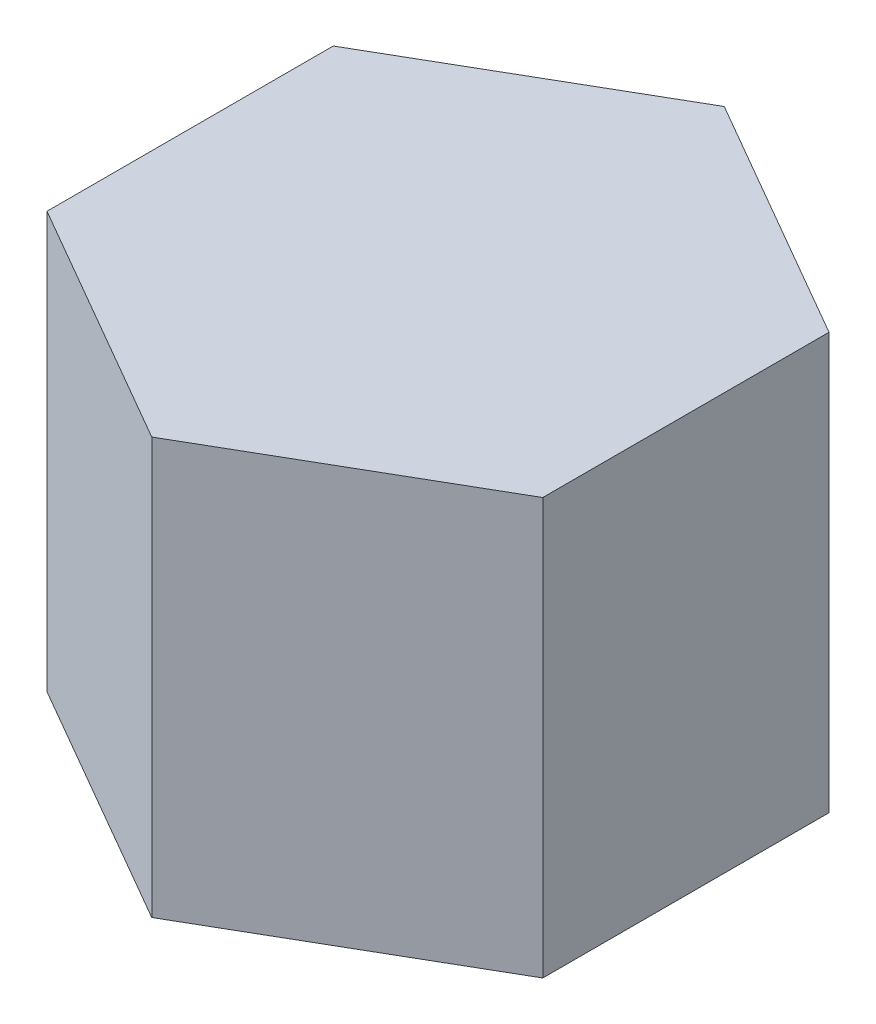
ISO-10303-21;
HEADER;
FILE_DESCRIPTION(('STEP AP214'),'2;1');
FILE_NAME('part.step','',(''),(''),'','','');
FILE_SCHEMA(('AUTOMOTIVE_DESIGN { 1 0 10303 214 1 1 1 1 }'));
ENDSEC;
DATA;
#1=APPLICATION_CONTEXT('core data for automotive mechanical design processes');
#2=APPLICATION_PROTOCOL_DEFINITION('international standard','automotive_design',2000,#1);
#3=PRODUCT_CONTEXT('',#1,'mechanical');
#4=PRODUCT('Part','Part','',(#3));
#5=PRODUCT_RELATED_PRODUCT_CATEGORY('part','',(#4));
#6=PRODUCT_DEFINITION_FORMATION('','',#4);
#7=PRODUCT_DEFINITION_CONTEXT('part definition',#1,'design');
#8=PRODUCT_DEFINITION('design','',#6,#7);
#9=PRODUCT_DEFINITION_SHAPE('','',#8);
#10=(LENGTH_UNIT() NAMED_UNIT(*) SI_UNIT(.MILLI.,.METRE.));
#11=(NAMED_UNIT(*) PLANE_ANGLE_UNIT() SI_UNIT($,.RADIAN.));
#12=(NAMED_UNIT(*) SI_UNIT($,.STERADIAN.) SOLID_ANGLE_UNIT());
#13=UNCERTAINTY_MEASURE_WITH_UNIT(LENGTH_MEASURE(1.E-05),#10,'distance_accuracy_value','');
#14=(GEOMETRIC_REPRESENTATION_CONTEXT(3) GLOBAL_UNCERTAINTY_ASSIGNED_CONTEXT((#13)) GLOBAL_UNIT_ASSIGNED_CONTEXT((#10,
#11,#12)) REPRESENTATION_CONTEXT('',''));
#15=CARTESIAN_POINT('',(0.,0.,0.));
#16=DIRECTION('',(0.,0.,1.));
#17=DIRECTION('',(1.,0.,0.));
#18=AXIS2_PLACEMENT_3D('',#15,#16,#17);
#19=CARTESIAN_POINT('',(209.339551417382,-147.556598747966,293.414022028063));
#20=DIRECTION('',(-0.500000000000028,0.,-0.866025403784422));
#21=DIRECTION('',(-0.866025403784423,0.,0.500000000000028));
#22=AXIS2_PLACEMENT_3D('',#19,#20,#21);
#23=PLANE('',#22);
#24=CARTESIAN_POINT('',(209.642660308706,-147.047793579175,293.239022028063));
#25=DIRECTION('',(-0.866025403784422,0.,0.500000000000028));
#26=VECTOR('',#25,1.);
#27=LINE('',#24,#26);
#28=CARTESIAN_POINT('',(209.642660308706,-147.047793579175,293.239022028063));
#29=VERTEX_POINT('',#28);
#30=CARTESIAN_POINT('',(209.339551417382,-147.047793579175,293.414022028063));
#31=VERTEX_POINT('',#30);
#32=EDGE_CURVE('E170',#29,#31,#27,.T.);
#33=ORIENTED_EDGE('',*,*,#32,.T.);
#34=CARTESIAN_POINT('',(209.339551417382,-147.556598747966,293.414022028063));
#35=DIRECTION('',(0.,1.,0.));
#36=VECTOR('',#35,1.);
#37=LINE('',#34,#36);
#38=CARTESIAN_POINT('',(209.339551417382,-147.556598747966,293.414022028063));
#39=VERTEX_POINT('',#38);
#40=EDGE_CURVE('E35',#39,#31,#37,.T.);
#41=ORIENTED_EDGE('',*,*,#40,.F.);
#42=CARTESIAN_POINT('',(209.642660308706,-147.556598747966,293.239022028063));
#43=DIRECTION('',(-0.866025403784422,0.,0.500000000000028));
#44=VECTOR('',#43,1.);
#45=LINE('',#42,#44);
#46=CARTESIAN_POINT('',(209.642660308706,-147.556598747966,293.239022028063));
#47=VERTEX_POINT('',#46);
#48=EDGE_CURVE('E159',#47,#39,#45,.T.);
#49=ORIENTED_EDGE('',*,*,#48,.F.);
#50=CARTESIAN_POINT('',(209.642660308706,-147.556598747966,293.239022028063));
#51=DIRECTION('',(0.,1.,0.));
#52=VECTOR('',#51,1.);
#53=LINE('',#50,#52);
#54=EDGE_CURVE('E10',#47,#29,#53,.T.);
#55=ORIENTED_EDGE('',*,*,#54,.T.);
#56=EDGE_LOOP('',(#33,#41,#49,#55));
#57=FACE_BOUND('',#56,.T.);
#58=ADVANCED_FACE('F16',(#57),#23,.F.);
#59=CARTESIAN_POINT('',(209.642660308706,-147.556598747966,291.594471220494));
#60=DIRECTION('',(-1.,0.,0.));
#61=DIRECTION('',(0.,-1.,0.));
#62=AXIS2_PLACEMENT_3D('',#59,#60,#61);
#63=PLANE('',#62);
#64=CARTESIAN_POINT('',(209.642660308706,-147.047793579175,292.889022028063));
#65=DIRECTION('',(0.,0.,1.));
#66=VECTOR('',#65,1.);
#67=LINE('',#64,#66);
#68=CARTESIAN_POINT('',(209.642660308706,-147.047793579175,292.889022028063));
#69=VERTEX_POINT('',#68);
#70=EDGE_CURVE('E167',#69,#29,#67,.T.);
#71=ORIENTED_EDGE('',*,*,#70,.T.);
#72=ORIENTED_EDGE('',*,*,#54,.F.);
#73=CARTESIAN_POINT('',(209.642660308706,-147.556598747966,292.889022028063));
#74=DIRECTION('',(0.,0.,1.));
#75=VECTOR('',#74,1.);
#76=LINE('',#73,#75);
#77=CARTESIAN_POINT('',(209.642660308706,-147.556598747966,292.889022028063));
#78=VERTEX_POINT('',#77);
#79=EDGE_CURVE('E156',#78,#47,#76,.T.);
#80=ORIENTED_EDGE('',*,*,#79,.F.);
#81=CARTESIAN_POINT('',(209.642660308706,-147.556598747966,292.889022028063));
#82=DIRECTION('',(0.,1.,0.));
#83=VECTOR('',#82,1.);
#84=LINE('',#81,#83);
#85=EDGE_CURVE('E27',#78,#69,#84,.T.);
#86=ORIENTED_EDGE('',*,*,#85,.T.);
#87=EDGE_LOOP('',(#71,#72,#80,#86));
#88=FACE_BOUND('',#87,.T.);
#89=ADVANCED_FACE('F189',(#88),#63,.F.);
#90=CARTESIAN_POINT('',(209.642660308706,-147.556598747966,292.889022028063));
#91=DIRECTION('',(-0.500000000000062,0.,0.866025403784403));
#92=DIRECTION('',(0.866025403784403,0.,0.500000000000062));
#93=AXIS2_PLACEMENT_3D('',#90,#91,#92);
#94=PLANE('',#93);
#95=CARTESIAN_POINT('',(209.339551417382,-147.047793579175,292.714022028063));
#96=DIRECTION('',(0.866025403784403,0.,0.500000000000062));
#97=VECTOR('',#96,1.);
#98=LINE('',#95,#97);
#99=CARTESIAN_POINT('',(209.339551417382,-147.047793579175,292.714022028063));
#100=VERTEX_POINT('',#99);
#101=EDGE_CURVE('E163',#100,#69,#98,.T.);
#102=ORIENTED_EDGE('',*,*,#101,.T.);
#103=ORIENTED_EDGE('',*,*,#85,.F.);
#104=CARTESIAN_POINT('',(209.339551417382,-147.556598747966,292.714022028063));
#105=DIRECTION('',(0.866025403784403,0.,0.500000000000062));
#106=VECTOR('',#105,1.);
#107=LINE('',#104,#106);
#108=CARTESIAN_POINT('',(209.339551417382,-147.556598747966,292.714022028063));
#109=VERTEX_POINT('',#108);
#110=EDGE_CURVE('E106',#109,#78,#107,.T.);
#111=ORIENTED_EDGE('',*,*,#110,.F.);
#112=CARTESIAN_POINT('',(209.339551417382,-147.556598747966,292.714022028063));
#113=DIRECTION('',(0.,1.,0.));
#114=VECTOR('',#113,1.);
#115=LINE('',#112,#114);
#116=EDGE_CURVE('E94',#109,#100,#115,.T.);
#117=ORIENTED_EDGE('',*,*,#116,.T.);
#118=EDGE_LOOP('',(#102,#103,#111,#117));
#119=FACE_BOUND('',#118,.T.);
#120=ADVANCED_FACE('F198',(#119),#94,.F.);
#121=CARTESIAN_POINT('',(209.339551417382,-147.556598747966,292.714022028063));
#122=DIRECTION('',(0.499999999999943,0.,0.866025403784471));
#123=DIRECTION('',(0.866025403784471,0.,-0.499999999999943));
#124=AXIS2_PLACEMENT_3D('',#121,#122,#123);
#125=PLANE('',#124);
#126=CARTESIAN_POINT('',(209.036442526057,-147.047793579175,292.889022028063));
#127=DIRECTION('',(0.866025403784471,0.,-0.499999999999943));
#128=VECTOR('',#127,1.);
#129=LINE('',#126,#128);
#130=CARTESIAN_POINT('',(209.036442526057,-147.047793579175,292.889022028063));
#131=VERTEX_POINT('',#130);
#132=EDGE_CURVE('E162',#131,#100,#129,.T.);
#133=ORIENTED_EDGE('',*,*,#132,.T.);
#134=ORIENTED_EDGE('',*,*,#116,.F.);
#135=CARTESIAN_POINT('',(209.036442526057,-147.556598747966,292.889022028063));
#136=DIRECTION('',(0.866025403784471,0.,-0.499999999999943));
#137=VECTOR('',#136,1.);
#138=LINE('',#135,#137);
#139=CARTESIAN_POINT('',(209.036442526057,-147.556598747966,292.889022028063));
#140=VERTEX_POINT('',#139);
#141=EDGE_CURVE('E98',#140,#109,#138,.T.);
#142=ORIENTED_EDGE('',*,*,#141,.F.);
#143=CARTESIAN_POINT('',(209.036442526057,-147.556598747966,292.889022028063));
#144=DIRECTION('',(0.,1.,0.));
#145=VECTOR('',#144,1.);
#146=LINE('',#143,#145);
#147=EDGE_CURVE('E79',#140,#131,#146,.T.);
#148=ORIENTED_EDGE('',*,*,#147,.T.);
#149=EDGE_LOOP('',(#133,#134,#142,#148));
#150=FACE_BOUND('',#149,.T.);
#151=ADVANCED_FACE('F100',(#150),#125,.F.);
#152=CARTESIAN_POINT('',(209.036442526057,-147.556598747966,291.594471220494));
#153=DIRECTION('',(1.,0.,0.));
#154=DIRECTION('',(0.,1.,0.));
#155=AXIS2_PLACEMENT_3D('',#152,#153,#154);
#156=PLANE('',#155);
#157=CARTESIAN_POINT('',(209.036442526057,-147.047793579175,293.239022028063));
#158=DIRECTION('',(0.,0.,-1.));
#159=VECTOR('',#158,1.);
#160=LINE('',#157,#159);
#161=CARTESIAN_POINT('',(209.036442526057,-147.047793579175,293.239022028063));
#162=VERTEX_POINT('',#161);
#163=EDGE_CURVE('E88',#162,#131,#160,.T.);
#164=ORIENTED_EDGE('',*,*,#163,.T.);
#165=ORIENTED_EDGE('',*,*,#147,.F.);
#166=CARTESIAN_POINT('',(209.036442526057,-147.556598747966,293.239022028063));
#167=DIRECTION('',(0.,0.,-1.));
#168=VECTOR('',#167,1.);
#169=LINE('',#166,#168);
#170=CARTESIAN_POINT('',(209.036442526057,-147.556598747966,293.239022028063));
#171=VERTEX_POINT('',#170);
#172=EDGE_CURVE('E84',#171,#140,#169,.T.);
#173=ORIENTED_EDGE('',*,*,#172,.F.);
#174=CARTESIAN_POINT('',(209.036442526057,-147.556598747966,293.239022028063));
#175=DIRECTION('',(0.,1.,0.));
#176=VECTOR('',#175,1.);
#177=LINE('',#174,#176);
#178=EDGE_CURVE('E58',#171,#162,#177,.T.);
#179=ORIENTED_EDGE('',*,*,#178,.T.);
#180=EDGE_LOOP('',(#164,#165,#173,#179));
#181=FACE_BOUND('',#180,.T.);
#182=ADVANCED_FACE('F82',(#181),#156,.F.);
#183=CARTESIAN_POINT('',(209.036442526057,-147.556598747966,293.239022028063));
#184=DIRECTION('',(0.499999999999978,0.,-0.866025403784452));
#185=DIRECTION('',(-0.866025403784452,0.,-0.499999999999978));
#186=AXIS2_PLACEMENT_3D('',#183,#184,#185);
#187=PLANE('',#186);
#188=CARTESIAN_POINT('',(209.339551417382,-147.047793579175,293.414022028063));
#189=DIRECTION('',(-0.866025403784452,0.,-0.499999999999978));
#190=VECTOR('',#189,1.);
#191=LINE('',#188,#190);
#192=EDGE_CURVE('E160',#31,#162,#191,.T.);
#193=ORIENTED_EDGE('',*,*,#192,.T.);
#194=ORIENTED_EDGE('',*,*,#178,.F.);
#195=CARTESIAN_POINT('',(209.339551417382,-147.556598747966,293.414022028063));
#196=DIRECTION('',(-0.866025403784452,0.,-0.499999999999978));
#197=VECTOR('',#196,1.);
#198=LINE('',#195,#197);
#199=EDGE_CURVE('E112',#39,#171,#198,.T.);
#200=ORIENTED_EDGE('',*,*,#199,.F.);
#201=ORIENTED_EDGE('',*,*,#40,.T.);
#202=EDGE_LOOP('',(#193,#194,#200,#201));
#203=FACE_BOUND('',#202,.T.);
#204=ADVANCED_FACE('F131',(#203),#187,.F.);
#205=CARTESIAN_POINT('',(206.491105863044,-147.556598747966,291.594471220494));
#206=DIRECTION('',(0.,1.,0.));
#207=DIRECTION('',(-1.,0.,0.));
#208=AXIS2_PLACEMENT_3D('',#205,#206,#207);
#209=PLANE('',#208);
#210=ORIENTED_EDGE('',*,*,#48,.T.);
#211=ORIENTED_EDGE('',*,*,#199,.T.);
#212=ORIENTED_EDGE('',*,*,#172,.T.);
#213=ORIENTED_EDGE('',*,*,#141,.T.);
#214=ORIENTED_EDGE('',*,*,#110,.T.);
#215=ORIENTED_EDGE('',*,*,#79,.T.);
#216=EDGE_LOOP('',(#210,#211,#212,#213,#214,#215));
#217=FACE_BOUND('',#216,.T.);
#218=ADVANCED_FACE('F111',(#217),#209,.F.);
#219=CARTESIAN_POINT('',(206.491105863044,-147.047793579175,291.594471220494));
#220=DIRECTION('',(0.,1.,0.));
#221=DIRECTION('',(-1.,0.,0.));
#222=AXIS2_PLACEMENT_3D('',#219,#220,#221);
#223=PLANE('',#222);
#224=ORIENTED_EDGE('',*,*,#32,.F.);
#225=ORIENTED_EDGE('',*,*,#70,.F.);
#226=ORIENTED_EDGE('',*,*,#101,.F.);
#227=ORIENTED_EDGE('',*,*,#132,.F.);
#228=ORIENTED_EDGE('',*,*,#163,.F.);
#229=ORIENTED_EDGE('',*,*,#192,.F.);
#230=EDGE_LOOP('',(#224,#225,#226,#227,#228,#229));
#231=FACE_BOUND('',#230,.T.);
#232=ADVANCED_FACE('F130',(#231),#223,.T.);
#233=CLOSED_SHELL('',(#58,#89,#120,#151,#182,#204,#218,#232));
#234=MANIFOLD_SOLID_BREP('B1',#233);
#235=ADVANCED_BREP_SHAPE_REPRESENTATION('',(#18,#234),#14);
#236=SHAPE_DEFINITION_REPRESENTATION(#9,#235);
ENDSEC;
END-ISO-10303-21;
